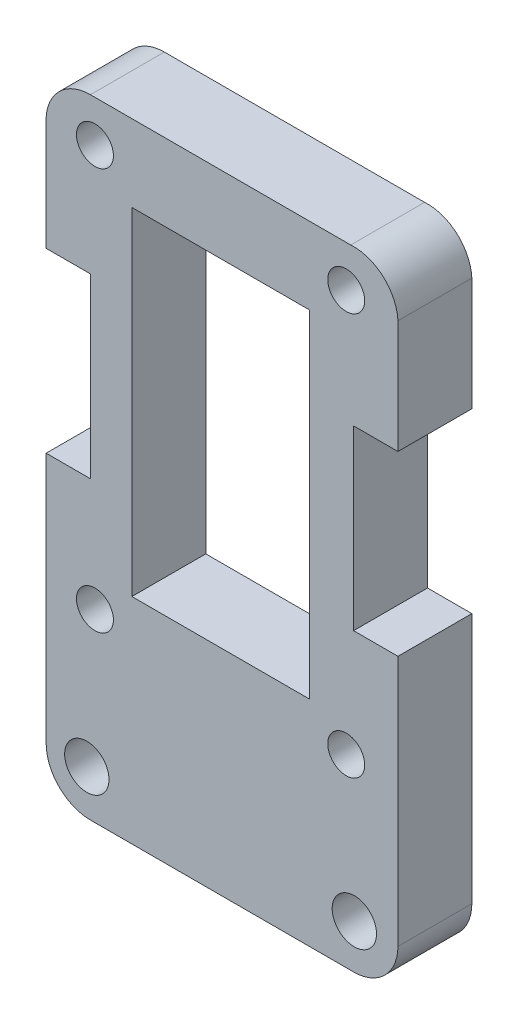
ISO-10303-21;
HEADER;
FILE_DESCRIPTION(('STEP AP214'),'2;1');
FILE_NAME('part.step','',(''),(''),'','','');
FILE_SCHEMA(('AUTOMOTIVE_DESIGN { 1 0 10303 214 1 1 1 1 }'));
ENDSEC;
DATA;
#1=APPLICATION_CONTEXT('core data for automotive mechanical design processes');
#2=APPLICATION_PROTOCOL_DEFINITION('international standard','automotive_design',2000,#1);
#3=PRODUCT_CONTEXT('',#1,'mechanical');
#4=PRODUCT('Part','Part','',(#3));
#5=PRODUCT_RELATED_PRODUCT_CATEGORY('part','',(#4));
#6=PRODUCT_DEFINITION_FORMATION('','',#4);
#7=PRODUCT_DEFINITION_CONTEXT('part definition',#1,'design');
#8=PRODUCT_DEFINITION('design','',#6,#7);
#9=PRODUCT_DEFINITION_SHAPE('','',#8);
#10=(LENGTH_UNIT() NAMED_UNIT(*) SI_UNIT(.MILLI.,.METRE.));
#11=(NAMED_UNIT(*) PLANE_ANGLE_UNIT() SI_UNIT($,.RADIAN.));
#12=(NAMED_UNIT(*) SI_UNIT($,.STERADIAN.) SOLID_ANGLE_UNIT());
#13=UNCERTAINTY_MEASURE_WITH_UNIT(LENGTH_MEASURE(1.E-05),#10,'distance_accuracy_value','');
#14=(GEOMETRIC_REPRESENTATION_CONTEXT(3) GLOBAL_UNCERTAINTY_ASSIGNED_CONTEXT((#13)) GLOBAL_UNIT_ASSIGNED_CONTEXT((#10,
#11,#12)) REPRESENTATION_CONTEXT('',''));
#15=CARTESIAN_POINT('',(0.,0.,0.));
#16=DIRECTION('',(0.,0.,1.));
#17=DIRECTION('',(1.,0.,0.));
#18=AXIS2_PLACEMENT_3D('',#15,#16,#17);
#19=CARTESIAN_POINT('',(2380.24311197819,1619.59431166584,5.));
#20=DIRECTION('',(0.,0.,1.));
#21=DIRECTION('',(1.,0.,0.));
#22=AXIS2_PLACEMENT_3D('',#19,#20,#21);
#23=PLANE('',#22);
#24=CARTESIAN_POINT('',(2362.73799590029,1592.58592744874,5.));
#25=DIRECTION('',(0.,0.,1.));
#26=DIRECTION('',(1.,0.,0.));
#27=AXIS2_PLACEMENT_3D('',#24,#25,#26);
#28=CIRCLE('',#27,1.25000000000008);
#29=CARTESIAN_POINT('',(2363.98799590029,1592.58592744874,5.));
#30=VERTEX_POINT('',#29);
#31=EDGE_CURVE('E730',#30,#30,#28,.T.);
#32=ORIENTED_EDGE('',*,*,#31,.F.);
#33=EDGE_LOOP('',(#32));
#34=FACE_BOUND('',#33,.T.);
#35=CARTESIAN_POINT('',(2380.28950112389,1583.08516678554,5.));
#36=DIRECTION('',(0.,0.,1.));
#37=DIRECTION('',(1.,0.,0.));
#38=AXIS2_PLACEMENT_3D('',#35,#36,#37);
#39=CIRCLE('',#38,1.50000000000011);
#40=CARTESIAN_POINT('',(2381.78950112389,1583.08516678554,5.));
#41=VERTEX_POINT('',#40);
#42=EDGE_CURVE('E746',#41,#41,#39,.T.);
#43=ORIENTED_EDGE('',*,*,#42,.F.);
#44=EDGE_LOOP('',(#43));
#45=FACE_BOUND('',#44,.T.);
#46=DIRECTION('',(0.,-1.,0.));
#47=VECTOR('',#46,1.);
#48=CARTESIAN_POINT('',(2365.23788577019,1617.38603758364,5.));
#49=LINE('',#48,#47);
#50=CARTESIAN_POINT('',(2365.23788577019,1617.38603758364,5.));
#51=VERTEX_POINT('',#50);
#52=CARTESIAN_POINT('',(2365.23788577019,1594.58603758364,5.));
#53=VERTEX_POINT('',#52);
#54=EDGE_CURVE('E186',#51,#53,#49,.T.);
#55=ORIENTED_EDGE('',*,*,#54,.F.);
#56=DIRECTION('',(-1.,0.,0.));
#57=VECTOR('',#56,1.);
#58=CARTESIAN_POINT('',(2377.23884660359,1617.38603758364,5.));
#59=LINE('',#58,#57);
#60=CARTESIAN_POINT('',(2377.23884660359,1617.38603758364,5.));
#61=VERTEX_POINT('',#60);
#62=EDGE_CURVE('E177',#61,#51,#59,.T.);
#63=ORIENTED_EDGE('',*,*,#62,.F.);
#64=DIRECTION('',(0.,1.,0.));
#65=VECTOR('',#64,1.);
#66=CARTESIAN_POINT('',(2377.23884660359,1594.58603758364,5.));
#67=LINE('',#66,#65);
#68=CARTESIAN_POINT('',(2377.23884660359,1594.58603758364,5.));
#69=VERTEX_POINT('',#68);
#70=EDGE_CURVE('E204',#69,#61,#67,.T.);
#71=ORIENTED_EDGE('',*,*,#70,.F.);
#72=DIRECTION('',(1.,0.,0.));
#73=VECTOR('',#72,1.);
#74=CARTESIAN_POINT('',(2365.23788577019,1594.58603758364,5.));
#75=LINE('',#74,#73);
#76=EDGE_CURVE('E200',#53,#69,#75,.T.);
#77=ORIENTED_EDGE('',*,*,#76,.F.);
#78=EDGE_LOOP('',(#55,#63,#71,#77));
#79=FACE_BOUND('',#78,.T.);
#80=CARTESIAN_POINT('',(2379.73935708099,1619.78810533794,5.));
#81=DIRECTION('',(0.,0.,1.));
#82=DIRECTION('',(1.,0.,0.));
#83=AXIS2_PLACEMENT_3D('',#80,#81,#82);
#84=CIRCLE('',#83,1.25000000000008);
#85=CARTESIAN_POINT('',(2380.98935708099,1619.78810533794,5.));
#86=VERTEX_POINT('',#85);
#87=EDGE_CURVE('E228',#86,#86,#84,.T.);
#88=ORIENTED_EDGE('',*,*,#87,.F.);
#89=EDGE_LOOP('',(#88));
#90=FACE_BOUND('',#89,.T.);
#91=CARTESIAN_POINT('',(2380.24311197819,1619.59431166584,5.));
#92=DIRECTION('',(0.,0.,1.));
#93=DIRECTION('',(1.,0.,0.));
#94=AXIS2_PLACEMENT_3D('',#91,#92,#93);
#95=CIRCLE('',#94,3.00012950662718);
#96=CARTESIAN_POINT('',(2383.23944711976,1619.74515189893,5.));
#97=VERTEX_POINT('',#96);
#98=CARTESIAN_POINT('',(2380.04318831135,1622.58777246965,5.));
#99=VERTEX_POINT('',#98);
#100=EDGE_CURVE('E236',#97,#99,#95,.T.);
#101=ORIENTED_EDGE('',*,*,#100,.T.);
#102=DIRECTION('',(-1.,7.43946413990091E-13,0.));
#103=VECTOR('',#102,1.);
#104=CARTESIAN_POINT('',(2362.4335440625,1622.58777246967,5.));
#105=LINE('',#104,#103);
#106=CARTESIAN_POINT('',(2362.4335440625,1622.58777246967,5.));
#107=VERTEX_POINT('',#106);
#108=EDGE_CURVE('E240',#99,#107,#105,.T.);
#109=ORIENTED_EDGE('',*,*,#108,.T.);
#110=CARTESIAN_POINT('',(2362.43354406253,1619.587642963,5.));
#111=DIRECTION('',(0.,0.,1.));
#112=DIRECTION('',(1.,0.,0.));
#113=AXIS2_PLACEMENT_3D('',#110,#111,#112);
#114=CIRCLE('',#113,3.00012950666476);
#115=CARTESIAN_POINT('',(2359.43752545989,1619.74464484014,5.));
#116=VERTEX_POINT('',#115);
#117=EDGE_CURVE('E244',#107,#116,#114,.T.);
#118=ORIENTED_EDGE('',*,*,#117,.T.);
#119=DIRECTION('',(0.,-1.,0.));
#120=VECTOR('',#119,1.);
#121=CARTESIAN_POINT('',(2359.43752545989,1619.74464484014,5.));
#122=LINE('',#121,#120);
#123=CARTESIAN_POINT('',(2359.43752545989,1612.08597090684,5.));
#124=VERTEX_POINT('',#123);
#125=EDGE_CURVE('E247',#116,#124,#122,.T.);
#126=ORIENTED_EDGE('',*,*,#125,.T.);
#127=DIRECTION('',(1.,0.,0.));
#128=VECTOR('',#127,1.);
#129=CARTESIAN_POINT('',(2359.43752545989,1612.08597090684,5.));
#130=LINE('',#129,#128);
#131=CARTESIAN_POINT('',(2362.43776566819,1612.08597090684,5.));
#132=VERTEX_POINT('',#131);
#133=EDGE_CURVE('E250',#124,#132,#130,.T.);
#134=ORIENTED_EDGE('',*,*,#133,.T.);
#135=DIRECTION('',(0.,-1.,0.));
#136=VECTOR('',#135,1.);
#137=CARTESIAN_POINT('',(2362.43776566819,1612.08597090684,5.));
#138=LINE('',#137,#136);
#139=CARTESIAN_POINT('',(2362.43776566819,1600.08597090684,5.));
#140=VERTEX_POINT('',#139);
#141=EDGE_CURVE('E253',#132,#140,#138,.T.);
#142=ORIENTED_EDGE('',*,*,#141,.T.);
#143=DIRECTION('',(-1.,0.,0.));
#144=VECTOR('',#143,1.);
#145=CARTESIAN_POINT('',(2359.43752545989,1600.08597090684,5.));
#146=LINE('',#145,#144);
#147=CARTESIAN_POINT('',(2359.43752545989,1600.08597090684,5.));
#148=VERTEX_POINT('',#147);
#149=EDGE_CURVE('E256',#140,#148,#146,.T.);
#150=ORIENTED_EDGE('',*,*,#149,.T.);
#151=DIRECTION('',(-3.01120357140416E-12,-1.,0.));
#152=VECTOR('',#151,1.);
#153=CARTESIAN_POINT('',(2359.43752545989,1600.08597090684,5.));
#154=LINE('',#153,#152);
#155=CARTESIAN_POINT('',(2359.43752545981,1583.08460972614,5.));
#156=VERTEX_POINT('',#155);
#157=EDGE_CURVE('E259',#148,#156,#154,.T.);
#158=ORIENTED_EDGE('',*,*,#157,.T.);
#159=CARTESIAN_POINT('',(2362.43783512489,1583.08467918284,5.));
#160=DIRECTION('',(0.,0.,1.));
#161=DIRECTION('',(1.,0.,0.));
#162=AXIS2_PLACEMENT_3D('',#159,#160,#161);
#163=CIRCLE('',#162,3.00030966588245);
#164=CARTESIAN_POINT('',(2362.33780187796,1580.0860375836,5.));
#165=VERTEX_POINT('',#164);
#166=EDGE_CURVE('E262',#156,#165,#163,.T.);
#167=ORIENTED_EDGE('',*,*,#166,.T.);
#168=DIRECTION('',(0.999999993647822,0.000112713597711161,0.));
#169=VECTOR('',#168,1.);
#170=CARTESIAN_POINT('',(2362.33780187796,1580.0860375836,5.));
#171=LINE('',#170,#169);
#172=CARTESIAN_POINT('',(2380.23940708099,1580.08805533794,5.));
#173=VERTEX_POINT('',#172);
#174=EDGE_CURVE('E265',#165,#173,#171,.T.);
#175=ORIENTED_EDGE('',*,*,#174,.T.);
#176=CARTESIAN_POINT('',(2380.23916689186,1583.08829552708,5.));
#177=DIRECTION('',(0.,0.,1.));
#178=DIRECTION('',(1.,0.,0.));
#179=AXIS2_PLACEMENT_3D('',#176,#177,#178);
#180=CIRCLE('',#179,3.00024019874928);
#181=CARTESIAN_POINT('',(2383.23940708099,1583.08805533794,5.));
#182=VERTEX_POINT('',#181);
#183=EDGE_CURVE('E268',#173,#182,#180,.T.);
#184=ORIENTED_EDGE('',*,*,#183,.T.);
#185=DIRECTION('',(2.35550645893528E-06,0.999999999997226,0.));
#186=VECTOR('',#185,1.);
#187=CARTESIAN_POINT('',(2383.23944711969,1600.08597090684,5.));
#188=LINE('',#187,#186);
#189=CARTESIAN_POINT('',(2383.23944711969,1600.08597090684,5.));
#190=VERTEX_POINT('',#189);
#191=EDGE_CURVE('E271',#182,#190,#188,.T.);
#192=ORIENTED_EDGE('',*,*,#191,.T.);
#193=DIRECTION('',(-1.,0.,0.));
#194=VECTOR('',#193,1.);
#195=CARTESIAN_POINT('',(2383.23944711969,1600.08597090684,5.));
#196=LINE('',#195,#194);
#197=CARTESIAN_POINT('',(2380.23944711969,1600.08597090684,5.));
#198=VERTEX_POINT('',#197);
#199=EDGE_CURVE('E274',#190,#198,#196,.T.);
#200=ORIENTED_EDGE('',*,*,#199,.T.);
#201=DIRECTION('',(0.,1.,0.));
#202=VECTOR('',#201,1.);
#203=CARTESIAN_POINT('',(2380.23944711969,1600.08597090684,5.));
#204=LINE('',#203,#202);
#205=CARTESIAN_POINT('',(2380.23944711969,1612.08597090684,5.));
#206=VERTEX_POINT('',#205);
#207=EDGE_CURVE('E277',#198,#206,#204,.T.);
#208=ORIENTED_EDGE('',*,*,#207,.T.);
#209=DIRECTION('',(1.,0.,0.));
#210=VECTOR('',#209,1.);
#211=CARTESIAN_POINT('',(2380.23944711969,1612.08597090684,5.));
#212=LINE('',#211,#210);
#213=CARTESIAN_POINT('',(2383.23944711969,1612.08597090684,5.));
#214=VERTEX_POINT('',#213);
#215=EDGE_CURVE('E280',#206,#214,#212,.T.);
#216=ORIENTED_EDGE('',*,*,#215,.T.);
#217=DIRECTION('',(9.45095060167521E-12,1.,0.));
#218=VECTOR('',#217,1.);
#219=CARTESIAN_POINT('',(2383.23944711976,1619.74515189893,5.));
#220=LINE('',#219,#218);
#221=EDGE_CURVE('E283',#214,#97,#220,.T.);
#222=ORIENTED_EDGE('',*,*,#221,.T.);
#223=EDGE_LOOP('',(#101,#109,#118,#126,#134,#142,#150,#158,#167,#175,#184,#192,#200,#208,#216,#222));
#224=FACE_BOUND('',#223,.T.);
#225=CARTESIAN_POINT('',(2379.73935708099,1592.58592744874,5.));
#226=DIRECTION('',(0.,0.,1.));
#227=DIRECTION('',(1.,0.,0.));
#228=AXIS2_PLACEMENT_3D('',#225,#226,#227);
#229=CIRCLE('',#228,1.25000000000008);
#230=CARTESIAN_POINT('',(2380.98935708099,1592.58592744874,5.));
#231=VERTEX_POINT('',#230);
#232=EDGE_CURVE('E212',#231,#231,#229,.T.);
#233=ORIENTED_EDGE('',*,*,#232,.F.);
#234=EDGE_LOOP('',(#233));
#235=FACE_BOUND('',#234,.T.);
#236=CARTESIAN_POINT('',(2362.18805186669,1583.08516678554,5.));
#237=DIRECTION('',(0.,0.,1.));
#238=DIRECTION('',(1.,0.,0.));
#239=AXIS2_PLACEMENT_3D('',#236,#237,#238);
#240=CIRCLE('',#239,1.50000000000011);
#241=CARTESIAN_POINT('',(2363.68805186669,1583.08516678554,5.));
#242=VERTEX_POINT('',#241);
#243=EDGE_CURVE('E738',#242,#242,#240,.T.);
#244=ORIENTED_EDGE('',*,*,#243,.F.);
#245=EDGE_LOOP('',(#244));
#246=FACE_BOUND('',#245,.T.);
#247=CARTESIAN_POINT('',(2362.73799590029,1619.78810533794,5.));
#248=DIRECTION('',(0.,0.,1.));
#249=DIRECTION('',(1.,0.,0.));
#250=AXIS2_PLACEMENT_3D('',#247,#248,#249);
#251=CIRCLE('',#250,1.25000000000008);
#252=CARTESIAN_POINT('',(2363.98799590029,1619.78810533794,5.));
#253=VERTEX_POINT('',#252);
#254=EDGE_CURVE('E719',#253,#253,#251,.T.);
#255=ORIENTED_EDGE('',*,*,#254,.F.);
#256=EDGE_LOOP('',(#255));
#257=FACE_BOUND('',#256,.T.);
#258=ADVANCED_FACE('F39',(#34,#45,#79,#90,#224,#235,#246,#257),#23,.T.);
#259=CARTESIAN_POINT('',(2380.24311197819,1619.59431166584,0.));
#260=DIRECTION('',(0.,0.,1.));
#261=DIRECTION('',(1.,0.,0.));
#262=AXIS2_PLACEMENT_3D('',#259,#260,#261);
#263=PLANE('',#262);
#264=CARTESIAN_POINT('',(2379.73935708099,1619.78810533794,0.));
#265=DIRECTION('',(0.,0.,1.));
#266=DIRECTION('',(1.,0.,0.));
#267=AXIS2_PLACEMENT_3D('',#264,#265,#266);
#268=CIRCLE('',#267,1.25000000000008);
#269=CARTESIAN_POINT('',(2380.98935708099,1619.78810533794,0.));
#270=VERTEX_POINT('',#269);
#271=EDGE_CURVE('E195',#270,#270,#268,.T.);
#272=ORIENTED_EDGE('',*,*,#271,.T.);
#273=EDGE_LOOP('',(#272));
#274=FACE_BOUND('',#273,.T.);
#275=CARTESIAN_POINT('',(2380.24311197819,1619.59431166584,0.));
#276=DIRECTION('',(0.,0.,1.));
#277=DIRECTION('',(1.,0.,0.));
#278=AXIS2_PLACEMENT_3D('',#275,#276,#277);
#279=CIRCLE('',#278,3.00012950662718);
#280=CARTESIAN_POINT('',(2383.23944711976,1619.74515189893,0.));
#281=VERTEX_POINT('',#280);
#282=CARTESIAN_POINT('',(2380.04318831135,1622.58777246965,0.));
#283=VERTEX_POINT('',#282);
#284=EDGE_CURVE('E232',#281,#283,#279,.T.);
#285=ORIENTED_EDGE('',*,*,#284,.F.);
#286=DIRECTION('',(9.45095060167521E-12,1.,0.));
#287=VECTOR('',#286,1.);
#288=CARTESIAN_POINT('',(2383.23944711976,1619.74515189893,0.));
#289=LINE('',#288,#287);
#290=CARTESIAN_POINT('',(2383.23944711969,1612.08597090684,0.));
#291=VERTEX_POINT('',#290);
#292=EDGE_CURVE('E241',#291,#281,#289,.T.);
#293=ORIENTED_EDGE('',*,*,#292,.F.);
#294=DIRECTION('',(1.,0.,0.));
#295=VECTOR('',#294,1.);
#296=CARTESIAN_POINT('',(2380.23944711969,1612.08597090684,0.));
#297=LINE('',#296,#295);
#298=CARTESIAN_POINT('',(2380.23944711969,1612.08597090684,0.));
#299=VERTEX_POINT('',#298);
#300=EDGE_CURVE('E330',#299,#291,#297,.T.);
#301=ORIENTED_EDGE('',*,*,#300,.F.);
#302=DIRECTION('',(0.,1.,0.));
#303=VECTOR('',#302,1.);
#304=CARTESIAN_POINT('',(2380.23944711969,1600.08597090684,0.));
#305=LINE('',#304,#303);
#306=CARTESIAN_POINT('',(2380.23944711969,1600.08597090684,0.));
#307=VERTEX_POINT('',#306);
#308=EDGE_CURVE('E327',#307,#299,#305,.T.);
#309=ORIENTED_EDGE('',*,*,#308,.F.);
#310=DIRECTION('',(-1.,0.,0.));
#311=VECTOR('',#310,1.);
#312=CARTESIAN_POINT('',(2383.23944711969,1600.08597090684,0.));
#313=LINE('',#312,#311);
#314=CARTESIAN_POINT('',(2383.23944711969,1600.08597090684,0.));
#315=VERTEX_POINT('',#314);
#316=EDGE_CURVE('E324',#315,#307,#313,.T.);
#317=ORIENTED_EDGE('',*,*,#316,.F.);
#318=DIRECTION('',(2.35550645893528E-06,0.999999999997226,0.));
#319=VECTOR('',#318,1.);
#320=CARTESIAN_POINT('',(2383.23944711969,1600.08597090684,0.));
#321=LINE('',#320,#319);
#322=CARTESIAN_POINT('',(2383.23940708099,1583.08805533794,0.));
#323=VERTEX_POINT('',#322);
#324=EDGE_CURVE('E321',#323,#315,#321,.T.);
#325=ORIENTED_EDGE('',*,*,#324,.F.);
#326=CARTESIAN_POINT('',(2380.23916689186,1583.08829552708,0.));
#327=DIRECTION('',(0.,0.,1.));
#328=DIRECTION('',(1.,0.,0.));
#329=AXIS2_PLACEMENT_3D('',#326,#327,#328);
#330=CIRCLE('',#329,3.00024019874928);
#331=CARTESIAN_POINT('',(2380.23940708099,1580.08805533794,0.));
#332=VERTEX_POINT('',#331);
#333=EDGE_CURVE('E318',#332,#323,#330,.T.);
#334=ORIENTED_EDGE('',*,*,#333,.F.);
#335=DIRECTION('',(0.999999993647822,0.000112713597711161,0.));
#336=VECTOR('',#335,1.);
#337=CARTESIAN_POINT('',(2362.33780187796,1580.0860375836,0.));
#338=LINE('',#337,#336);
#339=CARTESIAN_POINT('',(2362.33780187796,1580.0860375836,0.));
#340=VERTEX_POINT('',#339);
#341=EDGE_CURVE('E315',#340,#332,#338,.T.);
#342=ORIENTED_EDGE('',*,*,#341,.F.);
#343=CARTESIAN_POINT('',(2362.43783512489,1583.08467918284,0.));
#344=DIRECTION('',(0.,0.,1.));
#345=DIRECTION('',(1.,0.,0.));
#346=AXIS2_PLACEMENT_3D('',#343,#344,#345);
#347=CIRCLE('',#346,3.00030966588245);
#348=CARTESIAN_POINT('',(2359.43752545981,1583.08460972614,0.));
#349=VERTEX_POINT('',#348);
#350=EDGE_CURVE('E312',#349,#340,#347,.T.);
#351=ORIENTED_EDGE('',*,*,#350,.F.);
#352=DIRECTION('',(-8.67542761842058E-12,-1.,0.));
#353=VECTOR('',#352,1.);
#354=CARTESIAN_POINT('',(2359.43752545981,1583.08460972614,0.));
#355=LINE('',#354,#353);
#356=CARTESIAN_POINT('',(2359.43752545989,1600.08597090684,0.));
#357=VERTEX_POINT('',#356);
#358=EDGE_CURVE('E309',#357,#349,#355,.T.);
#359=ORIENTED_EDGE('',*,*,#358,.F.);
#360=DIRECTION('',(-1.,0.,0.));
#361=VECTOR('',#360,1.);
#362=CARTESIAN_POINT('',(2359.43752545989,1600.08597090684,0.));
#363=LINE('',#362,#361);
#364=CARTESIAN_POINT('',(2362.43776566819,1600.08597090684,0.));
#365=VERTEX_POINT('',#364);
#366=EDGE_CURVE('E305',#365,#357,#363,.T.);
#367=ORIENTED_EDGE('',*,*,#366,.F.);
#368=DIRECTION('',(0.,-1.,0.));
#369=VECTOR('',#368,1.);
#370=CARTESIAN_POINT('',(2362.43776566819,1612.08597090684,0.));
#371=LINE('',#370,#369);
#372=CARTESIAN_POINT('',(2362.43776566819,1612.08597090684,0.));
#373=VERTEX_POINT('',#372);
#374=EDGE_CURVE('E302',#373,#365,#371,.T.);
#375=ORIENTED_EDGE('',*,*,#374,.F.);
#376=DIRECTION('',(1.,0.,0.));
#377=VECTOR('',#376,1.);
#378=CARTESIAN_POINT('',(2359.43752545989,1612.08597090684,0.));
#379=LINE('',#378,#377);
#380=CARTESIAN_POINT('',(2359.43752545989,1612.08597090684,0.));
#381=VERTEX_POINT('',#380);
#382=EDGE_CURVE('E299',#381,#373,#379,.T.);
#383=ORIENTED_EDGE('',*,*,#382,.F.);
#384=DIRECTION('',(0.,-1.,0.));
#385=VECTOR('',#384,1.);
#386=CARTESIAN_POINT('',(2359.43752545989,1619.74464484014,0.));
#387=LINE('',#386,#385);
#388=CARTESIAN_POINT('',(2359.43752545989,1619.74464484014,0.));
#389=VERTEX_POINT('',#388);
#390=EDGE_CURVE('E296',#389,#381,#387,.T.);
#391=ORIENTED_EDGE('',*,*,#390,.F.);
#392=CARTESIAN_POINT('',(2362.43354406253,1619.587642963,0.));
#393=DIRECTION('',(0.,0.,1.));
#394=DIRECTION('',(1.,0.,0.));
#395=AXIS2_PLACEMENT_3D('',#392,#393,#394);
#396=CIRCLE('',#395,3.00012950666476);
#397=CARTESIAN_POINT('',(2362.4335440625,1622.58777246967,0.));
#398=VERTEX_POINT('',#397);
#399=EDGE_CURVE('E293',#398,#389,#396,.T.);
#400=ORIENTED_EDGE('',*,*,#399,.F.);
#401=DIRECTION('',(-1.,7.43946413990091E-13,0.));
#402=VECTOR('',#401,1.);
#403=CARTESIAN_POINT('',(2362.4335440625,1622.58777246967,0.));
#404=LINE('',#403,#402);
#405=EDGE_CURVE('E290',#283,#398,#404,.T.);
#406=ORIENTED_EDGE('',*,*,#405,.F.);
#407=EDGE_LOOP('',(#285,#293,#301,#309,#317,#325,#334,#342,#351,#359,#367,#375,#383,#391,#400,#406));
#408=FACE_BOUND('',#407,.T.);
#409=DIRECTION('',(-1.,0.,0.));
#410=VECTOR('',#409,1.);
#411=CARTESIAN_POINT('',(2377.23884660359,1617.38603758364,0.));
#412=LINE('',#411,#410);
#413=CARTESIAN_POINT('',(2377.23884660359,1617.38603758364,0.));
#414=VERTEX_POINT('',#413);
#415=CARTESIAN_POINT('',(2365.23788577019,1617.38603758364,0.));
#416=VERTEX_POINT('',#415);
#417=EDGE_CURVE('E63',#414,#416,#412,.T.);
#418=ORIENTED_EDGE('',*,*,#417,.T.);
#419=DIRECTION('',(0.,-1.,0.));
#420=VECTOR('',#419,1.);
#421=CARTESIAN_POINT('',(2365.23788577019,1617.38603758364,0.));
#422=LINE('',#421,#420);
#423=CARTESIAN_POINT('',(2365.23788577019,1594.58603758364,0.));
#424=VERTEX_POINT('',#423);
#425=EDGE_CURVE('E193',#416,#424,#422,.T.);
#426=ORIENTED_EDGE('',*,*,#425,.T.);
#427=DIRECTION('',(1.,0.,0.));
#428=VECTOR('',#427,1.);
#429=CARTESIAN_POINT('',(2365.23788577019,1594.58603758364,0.));
#430=LINE('',#429,#428);
#431=CARTESIAN_POINT('',(2377.23884660359,1594.58603758364,0.));
#432=VERTEX_POINT('',#431);
#433=EDGE_CURVE('E215',#424,#432,#430,.T.);
#434=ORIENTED_EDGE('',*,*,#433,.T.);
#435=DIRECTION('',(0.,1.,0.));
#436=VECTOR('',#435,1.);
#437=CARTESIAN_POINT('',(2377.23884660359,1594.58603758364,0.));
#438=LINE('',#437,#436);
#439=EDGE_CURVE('E187',#432,#414,#438,.T.);
#440=ORIENTED_EDGE('',*,*,#439,.T.);
#441=EDGE_LOOP('',(#418,#426,#434,#440));
#442=FACE_BOUND('',#441,.T.);
#443=CARTESIAN_POINT('',(2379.73935708099,1592.58592744874,0.));
#444=DIRECTION('',(0.,0.,1.));
#445=DIRECTION('',(1.,0.,0.));
#446=AXIS2_PLACEMENT_3D('',#443,#444,#445);
#447=CIRCLE('',#446,1.25000000000008);
#448=CARTESIAN_POINT('',(2380.98935708099,1592.58592744874,0.));
#449=VERTEX_POINT('',#448);
#450=EDGE_CURVE('E750',#449,#449,#447,.T.);
#451=ORIENTED_EDGE('',*,*,#450,.T.);
#452=EDGE_LOOP('',(#451));
#453=FACE_BOUND('',#452,.T.);
#454=CARTESIAN_POINT('',(2380.28950112389,1583.08516678554,0.));
#455=DIRECTION('',(0.,0.,1.));
#456=DIRECTION('',(1.,0.,0.));
#457=AXIS2_PLACEMENT_3D('',#454,#455,#456);
#458=CIRCLE('',#457,1.50000000000011);
#459=CARTESIAN_POINT('',(2381.78950112389,1583.08516678554,0.));
#460=VERTEX_POINT('',#459);
#461=EDGE_CURVE('E742',#460,#460,#458,.T.);
#462=ORIENTED_EDGE('',*,*,#461,.T.);
#463=EDGE_LOOP('',(#462));
#464=FACE_BOUND('',#463,.T.);
#465=CARTESIAN_POINT('',(2362.18805186669,1583.08516678554,0.));
#466=DIRECTION('',(0.,0.,1.));
#467=DIRECTION('',(1.,0.,0.));
#468=AXIS2_PLACEMENT_3D('',#465,#466,#467);
#469=CIRCLE('',#468,1.50000000000011);
#470=CARTESIAN_POINT('',(2363.68805186669,1583.08516678554,0.));
#471=VERTEX_POINT('',#470);
#472=EDGE_CURVE('E734',#471,#471,#469,.T.);
#473=ORIENTED_EDGE('',*,*,#472,.T.);
#474=EDGE_LOOP('',(#473));
#475=FACE_BOUND('',#474,.T.);
#476=CARTESIAN_POINT('',(2362.73799590029,1592.58592744874,0.));
#477=DIRECTION('',(0.,0.,1.));
#478=DIRECTION('',(1.,0.,0.));
#479=AXIS2_PLACEMENT_3D('',#476,#477,#478);
#480=CIRCLE('',#479,1.25000000000008);
#481=CARTESIAN_POINT('',(2363.98799590029,1592.58592744874,0.));
#482=VERTEX_POINT('',#481);
#483=EDGE_CURVE('E727',#482,#482,#480,.T.);
#484=ORIENTED_EDGE('',*,*,#483,.T.);
#485=EDGE_LOOP('',(#484));
#486=FACE_BOUND('',#485,.T.);
#487=CARTESIAN_POINT('',(2362.73799590029,1619.78810533794,0.));
#488=DIRECTION('',(0.,0.,1.));
#489=DIRECTION('',(1.,0.,0.));
#490=AXIS2_PLACEMENT_3D('',#487,#488,#489);
#491=CIRCLE('',#490,1.25000000000008);
#492=CARTESIAN_POINT('',(2363.98799590029,1619.78810533794,0.));
#493=VERTEX_POINT('',#492);
#494=EDGE_CURVE('E722',#493,#493,#491,.T.);
#495=ORIENTED_EDGE('',*,*,#494,.T.);
#496=EDGE_LOOP('',(#495));
#497=FACE_BOUND('',#496,.T.);
#498=ADVANCED_FACE('F401',(#274,#408,#442,#453,#464,#475,#486,#497),#263,.F.);
#499=CARTESIAN_POINT('',(2380.24311197819,1619.59431166584,5.));
#500=DIRECTION('',(0.,0.,-1.));
#501=DIRECTION('',(-1.,0.,0.));
#502=AXIS2_PLACEMENT_3D('',#499,#500,#501);
#503=CYLINDRICAL_SURFACE('',#502,3.00012950662718);
#504=ORIENTED_EDGE('',*,*,#284,.T.);
#505=DIRECTION('',(0.,0.,-1.));
#506=VECTOR('',#505,1.);
#507=CARTESIAN_POINT('',(2380.04318831135,1622.58777246965,5.));
#508=LINE('',#507,#506);
#509=EDGE_CURVE('E11',#99,#283,#508,.T.);
#510=ORIENTED_EDGE('',*,*,#509,.F.);
#511=ORIENTED_EDGE('',*,*,#100,.F.);
#512=DIRECTION('',(0.,0.,-1.));
#513=VECTOR('',#512,1.);
#514=CARTESIAN_POINT('',(2383.23944711976,1619.74515189893,5.));
#515=LINE('',#514,#513);
#516=EDGE_CURVE('E286',#97,#281,#515,.T.);
#517=ORIENTED_EDGE('',*,*,#516,.T.);
#518=EDGE_LOOP('',(#504,#510,#511,#517));
#519=FACE_BOUND('',#518,.T.);
#520=ADVANCED_FACE('F41',(#519),#503,.T.);
#521=CARTESIAN_POINT('',(2362.4335440625,1622.58777246967,5.));
#522=DIRECTION('',(-7.43946413990091E-13,-1.,0.));
#523=DIRECTION('',(1.,-7.43946413990091E-13,0.));
#524=AXIS2_PLACEMENT_3D('',#521,#522,#523);
#525=PLANE('',#524);
#526=ORIENTED_EDGE('',*,*,#405,.T.);
#527=DIRECTION('',(0.,0.,-1.));
#528=VECTOR('',#527,1.);
#529=CARTESIAN_POINT('',(2362.4335440625,1622.58777246967,5.));
#530=LINE('',#529,#528);
#531=EDGE_CURVE('E48',#107,#398,#530,.T.);
#532=ORIENTED_EDGE('',*,*,#531,.F.);
#533=ORIENTED_EDGE('',*,*,#108,.F.);
#534=ORIENTED_EDGE('',*,*,#509,.T.);
#535=EDGE_LOOP('',(#526,#532,#533,#534));
#536=FACE_BOUND('',#535,.T.);
#537=ADVANCED_FACE('F419',(#536),#525,.F.);
#538=CARTESIAN_POINT('',(2362.43354406253,1619.587642963,5.));
#539=DIRECTION('',(0.,0.,-1.));
#540=DIRECTION('',(-1.,0.,0.));
#541=AXIS2_PLACEMENT_3D('',#538,#539,#540);
#542=CYLINDRICAL_SURFACE('',#541,3.00012950666476);
#543=ORIENTED_EDGE('',*,*,#399,.T.);
#544=DIRECTION('',(0.,0.,-1.));
#545=VECTOR('',#544,1.);
#546=CARTESIAN_POINT('',(2359.43752545989,1619.74464484014,5.));
#547=LINE('',#546,#545);
#548=EDGE_CURVE('E386',#116,#389,#547,.T.);
#549=ORIENTED_EDGE('',*,*,#548,.F.);
#550=ORIENTED_EDGE('',*,*,#117,.F.);
#551=ORIENTED_EDGE('',*,*,#531,.T.);
#552=EDGE_LOOP('',(#543,#549,#550,#551));
#553=FACE_BOUND('',#552,.T.);
#554=ADVANCED_FACE('F395',(#553),#542,.T.);
#555=CARTESIAN_POINT('',(2359.43752545989,1619.74464484014,5.));
#556=DIRECTION('',(1.,0.,0.));
#557=DIRECTION('',(0.,0.,-1.));
#558=AXIS2_PLACEMENT_3D('',#555,#556,#557);
#559=PLANE('',#558);
#560=ORIENTED_EDGE('',*,*,#390,.T.);
#561=DIRECTION('',(0.,0.,-1.));
#562=VECTOR('',#561,1.);
#563=CARTESIAN_POINT('',(2359.43752545989,1612.08597090684,5.));
#564=LINE('',#563,#562);
#565=EDGE_CURVE('E382',#124,#381,#564,.T.);
#566=ORIENTED_EDGE('',*,*,#565,.F.);
#567=ORIENTED_EDGE('',*,*,#125,.F.);
#568=ORIENTED_EDGE('',*,*,#548,.T.);
#569=EDGE_LOOP('',(#560,#566,#567,#568));
#570=FACE_BOUND('',#569,.T.);
#571=ADVANCED_FACE('F407',(#570),#559,.F.);
#572=CARTESIAN_POINT('',(2359.43752545989,1612.08597090684,5.));
#573=DIRECTION('',(0.,1.,0.));
#574=DIRECTION('',(0.,0.,1.));
#575=AXIS2_PLACEMENT_3D('',#572,#573,#574);
#576=PLANE('',#575);
#577=ORIENTED_EDGE('',*,*,#382,.T.);
#578=DIRECTION('',(0.,0.,-1.));
#579=VECTOR('',#578,1.);
#580=CARTESIAN_POINT('',(2362.43776566819,1612.08597090684,5.));
#581=LINE('',#580,#579);
#582=EDGE_CURVE('E378',#132,#373,#581,.T.);
#583=ORIENTED_EDGE('',*,*,#582,.F.);
#584=ORIENTED_EDGE('',*,*,#133,.F.);
#585=ORIENTED_EDGE('',*,*,#565,.T.);
#586=EDGE_LOOP('',(#577,#583,#584,#585));
#587=FACE_BOUND('',#586,.T.);
#588=ADVANCED_FACE('F411',(#587),#576,.F.);
#589=CARTESIAN_POINT('',(2362.43776566819,1612.08597090684,5.));
#590=DIRECTION('',(1.,0.,0.));
#591=DIRECTION('',(0.,0.,-1.));
#592=AXIS2_PLACEMENT_3D('',#589,#590,#591);
#593=PLANE('',#592);
#594=ORIENTED_EDGE('',*,*,#374,.T.);
#595=DIRECTION('',(0.,0.,-1.));
#596=VECTOR('',#595,1.);
#597=CARTESIAN_POINT('',(2362.43776566819,1600.08597090684,5.));
#598=LINE('',#597,#596);
#599=EDGE_CURVE('E374',#140,#365,#598,.T.);
#600=ORIENTED_EDGE('',*,*,#599,.F.);
#601=ORIENTED_EDGE('',*,*,#141,.F.);
#602=ORIENTED_EDGE('',*,*,#582,.T.);
#603=EDGE_LOOP('',(#594,#600,#601,#602));
#604=FACE_BOUND('',#603,.T.);
#605=ADVANCED_FACE('F471',(#604),#593,.F.);
#606=CARTESIAN_POINT('',(2359.43752545989,1600.08597090684,5.));
#607=DIRECTION('',(0.,-1.,0.));
#608=DIRECTION('',(0.,0.,-1.));
#609=AXIS2_PLACEMENT_3D('',#606,#607,#608);
#610=PLANE('',#609);
#611=ORIENTED_EDGE('',*,*,#366,.T.);
#612=DIRECTION('',(0.,0.,-1.));
#613=VECTOR('',#612,1.);
#614=CARTESIAN_POINT('',(2359.43752545989,1600.08597090684,5.));
#615=LINE('',#614,#613);
#616=EDGE_CURVE('E370',#148,#357,#615,.T.);
#617=ORIENTED_EDGE('',*,*,#616,.F.);
#618=ORIENTED_EDGE('',*,*,#149,.F.);
#619=ORIENTED_EDGE('',*,*,#599,.T.);
#620=EDGE_LOOP('',(#611,#617,#618,#619));
#621=FACE_BOUND('',#620,.T.);
#622=ADVANCED_FACE('F468',(#621),#610,.F.);
#623=CARTESIAN_POINT('',(2359.43752545981,1583.08460972614,5.));
#624=DIRECTION('',(1.,-8.67542761842058E-12,0.));
#625=DIRECTION('',(8.67542761842058E-12,1.,0.));
#626=AXIS2_PLACEMENT_3D('',#623,#624,#625);
#627=PLANE('',#626);
#628=ORIENTED_EDGE('',*,*,#358,.T.);
#629=DIRECTION('',(0.,0.,-1.));
#630=VECTOR('',#629,1.);
#631=CARTESIAN_POINT('',(2359.43752545981,1583.08460972614,5.));
#632=LINE('',#631,#630);
#633=EDGE_CURVE('E366',#156,#349,#632,.T.);
#634=ORIENTED_EDGE('',*,*,#633,.F.);
#635=ORIENTED_EDGE('',*,*,#157,.F.);
#636=ORIENTED_EDGE('',*,*,#616,.T.);
#637=EDGE_LOOP('',(#628,#634,#635,#636));
#638=FACE_BOUND('',#637,.T.);
#639=ADVANCED_FACE('F464',(#638),#627,.F.);
#640=CARTESIAN_POINT('',(2362.43783512489,1583.08467918284,5.));
#641=DIRECTION('',(0.,0.,-1.));
#642=DIRECTION('',(-1.,0.,0.));
#643=AXIS2_PLACEMENT_3D('',#640,#641,#642);
#644=CYLINDRICAL_SURFACE('',#643,3.00030966588245);
#645=ORIENTED_EDGE('',*,*,#350,.T.);
#646=DIRECTION('',(0.,0.,-1.));
#647=VECTOR('',#646,1.);
#648=CARTESIAN_POINT('',(2362.33780187796,1580.0860375836,5.));
#649=LINE('',#648,#647);
#650=EDGE_CURVE('E362',#165,#340,#649,.T.);
#651=ORIENTED_EDGE('',*,*,#650,.F.);
#652=ORIENTED_EDGE('',*,*,#166,.F.);
#653=ORIENTED_EDGE('',*,*,#633,.T.);
#654=EDGE_LOOP('',(#645,#651,#652,#653));
#655=FACE_BOUND('',#654,.T.);
#656=ADVANCED_FACE('F460',(#655),#644,.T.);
#657=CARTESIAN_POINT('',(2362.33780187796,1580.0860375836,5.));
#658=DIRECTION('',(-0.000112713597711161,0.999999993647822,0.));
#659=DIRECTION('',(-0.999999993647823,-0.000112713597711161,0.));
#660=AXIS2_PLACEMENT_3D('',#657,#658,#659);
#661=PLANE('',#660);
#662=ORIENTED_EDGE('',*,*,#341,.T.);
#663=DIRECTION('',(0.,0.,-1.));
#664=VECTOR('',#663,1.);
#665=CARTESIAN_POINT('',(2380.23940708099,1580.08805533794,5.));
#666=LINE('',#665,#664);
#667=EDGE_CURVE('E358',#173,#332,#666,.T.);
#668=ORIENTED_EDGE('',*,*,#667,.F.);
#669=ORIENTED_EDGE('',*,*,#174,.F.);
#670=ORIENTED_EDGE('',*,*,#650,.T.);
#671=EDGE_LOOP('',(#662,#668,#669,#670));
#672=FACE_BOUND('',#671,.T.);
#673=ADVANCED_FACE('F455',(#672),#661,.F.);
#674=CARTESIAN_POINT('',(2380.23916689186,1583.08829552708,5.));
#675=DIRECTION('',(0.,0.,-1.));
#676=DIRECTION('',(-1.,0.,0.));
#677=AXIS2_PLACEMENT_3D('',#674,#675,#676);
#678=CYLINDRICAL_SURFACE('',#677,3.00024019874928);
#679=ORIENTED_EDGE('',*,*,#333,.T.);
#680=DIRECTION('',(0.,0.,-1.));
#681=VECTOR('',#680,1.);
#682=CARTESIAN_POINT('',(2383.23940708099,1583.08805533794,5.));
#683=LINE('',#682,#681);
#684=EDGE_CURVE('E354',#182,#323,#683,.T.);
#685=ORIENTED_EDGE('',*,*,#684,.F.);
#686=ORIENTED_EDGE('',*,*,#183,.F.);
#687=ORIENTED_EDGE('',*,*,#667,.T.);
#688=EDGE_LOOP('',(#679,#685,#686,#687));
#689=FACE_BOUND('',#688,.T.);
#690=ADVANCED_FACE('F450',(#689),#678,.T.);
#691=CARTESIAN_POINT('',(2383.23944711969,1600.08597090684,5.));
#692=DIRECTION('',(-0.999999999997226,2.35550645893528E-06,0.));
#693=DIRECTION('',(-2.35550645893528E-06,-0.999999999997226,0.));
#694=AXIS2_PLACEMENT_3D('',#691,#692,#693);
#695=PLANE('',#694);
#696=ORIENTED_EDGE('',*,*,#324,.T.);
#697=DIRECTION('',(0.,0.,-1.));
#698=VECTOR('',#697,1.);
#699=CARTESIAN_POINT('',(2383.23944711969,1600.08597090684,5.));
#700=LINE('',#699,#698);
#701=EDGE_CURVE('E350',#190,#315,#700,.T.);
#702=ORIENTED_EDGE('',*,*,#701,.F.);
#703=ORIENTED_EDGE('',*,*,#191,.F.);
#704=ORIENTED_EDGE('',*,*,#684,.T.);
#705=EDGE_LOOP('',(#696,#702,#703,#704));
#706=FACE_BOUND('',#705,.T.);
#707=ADVANCED_FACE('F446',(#706),#695,.F.);
#708=CARTESIAN_POINT('',(2383.23944711969,1600.08597090684,5.));
#709=DIRECTION('',(0.,-1.,0.));
#710=DIRECTION('',(0.,0.,-1.));
#711=AXIS2_PLACEMENT_3D('',#708,#709,#710);
#712=PLANE('',#711);
#713=ORIENTED_EDGE('',*,*,#316,.T.);
#714=DIRECTION('',(0.,0.,-1.));
#715=VECTOR('',#714,1.);
#716=CARTESIAN_POINT('',(2380.23944711969,1600.08597090684,5.));
#717=LINE('',#716,#715);
#718=EDGE_CURVE('E346',#198,#307,#717,.T.);
#719=ORIENTED_EDGE('',*,*,#718,.F.);
#720=ORIENTED_EDGE('',*,*,#199,.F.);
#721=ORIENTED_EDGE('',*,*,#701,.T.);
#722=EDGE_LOOP('',(#713,#719,#720,#721));
#723=FACE_BOUND('',#722,.T.);
#724=ADVANCED_FACE('F441',(#723),#712,.F.);
#725=CARTESIAN_POINT('',(2380.23944711969,1600.08597090684,5.));
#726=DIRECTION('',(-1.,0.,0.));
#727=DIRECTION('',(0.,0.,1.));
#728=AXIS2_PLACEMENT_3D('',#725,#726,#727);
#729=PLANE('',#728);
#730=ORIENTED_EDGE('',*,*,#308,.T.);
#731=DIRECTION('',(0.,0.,-1.));
#732=VECTOR('',#731,1.);
#733=CARTESIAN_POINT('',(2380.23944711969,1612.08597090684,5.));
#734=LINE('',#733,#732);
#735=EDGE_CURVE('E342',#206,#299,#734,.T.);
#736=ORIENTED_EDGE('',*,*,#735,.F.);
#737=ORIENTED_EDGE('',*,*,#207,.F.);
#738=ORIENTED_EDGE('',*,*,#718,.T.);
#739=EDGE_LOOP('',(#730,#736,#737,#738));
#740=FACE_BOUND('',#739,.T.);
#741=ADVANCED_FACE('F435',(#740),#729,.F.);
#742=CARTESIAN_POINT('',(2380.23944711969,1612.08597090684,5.));
#743=DIRECTION('',(0.,1.,0.));
#744=DIRECTION('',(0.,0.,1.));
#745=AXIS2_PLACEMENT_3D('',#742,#743,#744);
#746=PLANE('',#745);
#747=ORIENTED_EDGE('',*,*,#300,.T.);
#748=DIRECTION('',(0.,0.,-1.));
#749=VECTOR('',#748,1.);
#750=CARTESIAN_POINT('',(2383.23944711969,1612.08597090684,5.));
#751=LINE('',#750,#749);
#752=EDGE_CURVE('E338',#214,#291,#751,.T.);
#753=ORIENTED_EDGE('',*,*,#752,.F.);
#754=ORIENTED_EDGE('',*,*,#215,.F.);
#755=ORIENTED_EDGE('',*,*,#735,.T.);
#756=EDGE_LOOP('',(#747,#753,#754,#755));
#757=FACE_BOUND('',#756,.T.);
#758=ADVANCED_FACE('F431',(#757),#746,.F.);
#759=CARTESIAN_POINT('',(2383.23944711976,1619.74515189893,5.));
#760=DIRECTION('',(-1.,9.45095060167521E-12,0.));
#761=DIRECTION('',(-9.45095060167521E-12,-1.,0.));
#762=AXIS2_PLACEMENT_3D('',#759,#760,#761);
#763=PLANE('',#762);
#764=ORIENTED_EDGE('',*,*,#292,.T.);
#765=ORIENTED_EDGE('',*,*,#516,.F.);
#766=ORIENTED_EDGE('',*,*,#221,.F.);
#767=ORIENTED_EDGE('',*,*,#752,.T.);
#768=EDGE_LOOP('',(#764,#765,#766,#767));
#769=FACE_BOUND('',#768,.T.);
#770=ADVANCED_FACE('F426',(#769),#763,.F.);
#771=CARTESIAN_POINT('',(2379.73935708099,1619.78810533794,5.));
#772=DIRECTION('',(0.,0.,-1.));
#773=DIRECTION('',(-1.,0.,0.));
#774=AXIS2_PLACEMENT_3D('',#771,#772,#773);
#775=CYLINDRICAL_SURFACE('',#774,1.25000000000008);
#776=ORIENTED_EDGE('',*,*,#87,.T.);
#777=EDGE_LOOP('',(#776));
#778=FACE_BOUND('',#777,.T.);
#779=ORIENTED_EDGE('',*,*,#271,.F.);
#780=EDGE_LOOP('',(#779));
#781=FACE_BOUND('',#780,.T.);
#782=ADVANCED_FACE('F491',(#778,#781),#775,.F.);
#783=CARTESIAN_POINT('',(2377.23884660359,1617.38603758364,5.));
#784=DIRECTION('',(0.,-1.,0.));
#785=DIRECTION('',(0.,0.,-1.));
#786=AXIS2_PLACEMENT_3D('',#783,#784,#785);
#787=PLANE('',#786);
#788=ORIENTED_EDGE('',*,*,#417,.F.);
#789=DIRECTION('',(0.,0.,-1.));
#790=VECTOR('',#789,1.);
#791=CARTESIAN_POINT('',(2377.23884660359,1617.38603758364,5.));
#792=LINE('',#791,#790);
#793=EDGE_CURVE('E181',#61,#414,#792,.T.);
#794=ORIENTED_EDGE('',*,*,#793,.F.);
#795=ORIENTED_EDGE('',*,*,#62,.T.);
#796=DIRECTION('',(0.,0.,-1.));
#797=VECTOR('',#796,1.);
#798=CARTESIAN_POINT('',(2365.23788577019,1617.38603758364,5.));
#799=LINE('',#798,#797);
#800=EDGE_CURVE('E180',#51,#416,#799,.T.);
#801=ORIENTED_EDGE('',*,*,#800,.T.);
#802=EDGE_LOOP('',(#788,#794,#795,#801));
#803=FACE_BOUND('',#802,.T.);
#804=ADVANCED_FACE('F179',(#803),#787,.T.);
#805=CARTESIAN_POINT('',(2365.23788577019,1617.38603758364,5.));
#806=DIRECTION('',(1.,0.,0.));
#807=DIRECTION('',(0.,0.,-1.));
#808=AXIS2_PLACEMENT_3D('',#805,#806,#807);
#809=PLANE('',#808);
#810=ORIENTED_EDGE('',*,*,#425,.F.);
#811=ORIENTED_EDGE('',*,*,#800,.F.);
#812=ORIENTED_EDGE('',*,*,#54,.T.);
#813=DIRECTION('',(0.,0.,-1.));
#814=VECTOR('',#813,1.);
#815=CARTESIAN_POINT('',(2365.23788577019,1594.58603758364,5.));
#816=LINE('',#815,#814);
#817=EDGE_CURVE('E196',#53,#424,#816,.T.);
#818=ORIENTED_EDGE('',*,*,#817,.T.);
#819=EDGE_LOOP('',(#810,#811,#812,#818));
#820=FACE_BOUND('',#819,.T.);
#821=ADVANCED_FACE('F190',(#820),#809,.T.);
#822=CARTESIAN_POINT('',(2365.23788577019,1594.58603758364,5.));
#823=DIRECTION('',(0.,1.,0.));
#824=DIRECTION('',(0.,0.,1.));
#825=AXIS2_PLACEMENT_3D('',#822,#823,#824);
#826=PLANE('',#825);
#827=ORIENTED_EDGE('',*,*,#433,.F.);
#828=ORIENTED_EDGE('',*,*,#817,.F.);
#829=ORIENTED_EDGE('',*,*,#76,.T.);
#830=DIRECTION('',(0.,0.,-1.));
#831=VECTOR('',#830,1.);
#832=CARTESIAN_POINT('',(2377.23884660359,1594.58603758364,5.));
#833=LINE('',#832,#831);
#834=EDGE_CURVE('E55',#69,#432,#833,.T.);
#835=ORIENTED_EDGE('',*,*,#834,.T.);
#836=EDGE_LOOP('',(#827,#828,#829,#835));
#837=FACE_BOUND('',#836,.T.);
#838=ADVANCED_FACE('F564',(#837),#826,.T.);
#839=CARTESIAN_POINT('',(2377.23884660359,1594.58603758364,5.));
#840=DIRECTION('',(-1.,0.,0.));
#841=DIRECTION('',(0.,0.,1.));
#842=AXIS2_PLACEMENT_3D('',#839,#840,#841);
#843=PLANE('',#842);
#844=ORIENTED_EDGE('',*,*,#439,.F.);
#845=ORIENTED_EDGE('',*,*,#834,.F.);
#846=ORIENTED_EDGE('',*,*,#70,.T.);
#847=ORIENTED_EDGE('',*,*,#793,.T.);
#848=EDGE_LOOP('',(#844,#845,#846,#847));
#849=FACE_BOUND('',#848,.T.);
#850=ADVANCED_FACE('F571',(#849),#843,.T.);
#851=CARTESIAN_POINT('',(2379.73935708099,1592.58592744874,5.));
#852=DIRECTION('',(0.,0.,-1.));
#853=DIRECTION('',(-1.,0.,0.));
#854=AXIS2_PLACEMENT_3D('',#851,#852,#853);
#855=CYLINDRICAL_SURFACE('',#854,1.25000000000008);
#856=ORIENTED_EDGE('',*,*,#232,.T.);
#857=EDGE_LOOP('',(#856));
#858=FACE_BOUND('',#857,.T.);
#859=ORIENTED_EDGE('',*,*,#450,.F.);
#860=EDGE_LOOP('',(#859));
#861=FACE_BOUND('',#860,.T.);
#862=ADVANCED_FACE('F579',(#858,#861),#855,.F.);
#863=CARTESIAN_POINT('',(2380.28950112389,1583.08516678554,5.));
#864=DIRECTION('',(0.,0.,-1.));
#865=DIRECTION('',(-1.,0.,0.));
#866=AXIS2_PLACEMENT_3D('',#863,#864,#865);
#867=CYLINDRICAL_SURFACE('',#866,1.50000000000011);
#868=ORIENTED_EDGE('',*,*,#42,.T.);
#869=EDGE_LOOP('',(#868));
#870=FACE_BOUND('',#869,.T.);
#871=ORIENTED_EDGE('',*,*,#461,.F.);
#872=EDGE_LOOP('',(#871));
#873=FACE_BOUND('',#872,.T.);
#874=ADVANCED_FACE('F586',(#870,#873),#867,.F.);
#875=CARTESIAN_POINT('',(2362.18805186669,1583.08516678554,5.));
#876=DIRECTION('',(0.,0.,-1.));
#877=DIRECTION('',(-1.,0.,0.));
#878=AXIS2_PLACEMENT_3D('',#875,#876,#877);
#879=CYLINDRICAL_SURFACE('',#878,1.50000000000011);
#880=ORIENTED_EDGE('',*,*,#243,.T.);
#881=EDGE_LOOP('',(#880));
#882=FACE_BOUND('',#881,.T.);
#883=ORIENTED_EDGE('',*,*,#472,.F.);
#884=EDGE_LOOP('',(#883));
#885=FACE_BOUND('',#884,.T.);
#886=ADVANCED_FACE('F594',(#882,#885),#879,.F.);
#887=CARTESIAN_POINT('',(2362.73799590029,1592.58592744874,5.));
#888=DIRECTION('',(0.,0.,-1.));
#889=DIRECTION('',(-1.,0.,0.));
#890=AXIS2_PLACEMENT_3D('',#887,#888,#889);
#891=CYLINDRICAL_SURFACE('',#890,1.25000000000008);
#892=ORIENTED_EDGE('',*,*,#31,.T.);
#893=EDGE_LOOP('',(#892));
#894=FACE_BOUND('',#893,.T.);
#895=ORIENTED_EDGE('',*,*,#483,.F.);
#896=EDGE_LOOP('',(#895));
#897=FACE_BOUND('',#896,.T.);
#898=ADVANCED_FACE('F602',(#894,#897),#891,.F.);
#899=CARTESIAN_POINT('',(2362.73799590029,1619.78810533794,5.));
#900=DIRECTION('',(0.,0.,-1.));
#901=DIRECTION('',(-1.,0.,0.));
#902=AXIS2_PLACEMENT_3D('',#899,#900,#901);
#903=CYLINDRICAL_SURFACE('',#902,1.25000000000008);
#904=ORIENTED_EDGE('',*,*,#254,.T.);
#905=EDGE_LOOP('',(#904));
#906=FACE_BOUND('',#905,.T.);
#907=ORIENTED_EDGE('',*,*,#494,.F.);
#908=EDGE_LOOP('',(#907));
#909=FACE_BOUND('',#908,.T.);
#910=ADVANCED_FACE('F610',(#906,#909),#903,.F.);
#911=CLOSED_SHELL('',(#258,#498,#520,#537,#554,#571,#588,#605,#622,#639,#656,#673,#690,#707,
#724,#741,#758,#770,#782,#804,#821,#838,#850,#862,#874,#886,#898,#910));
#912=MANIFOLD_SOLID_BREP('B2',#911);
#913=ADVANCED_BREP_SHAPE_REPRESENTATION('',(#18,#912),#14);
#914=SHAPE_DEFINITION_REPRESENTATION(#9,#913);
ENDSEC;
END-ISO-10303-21;
